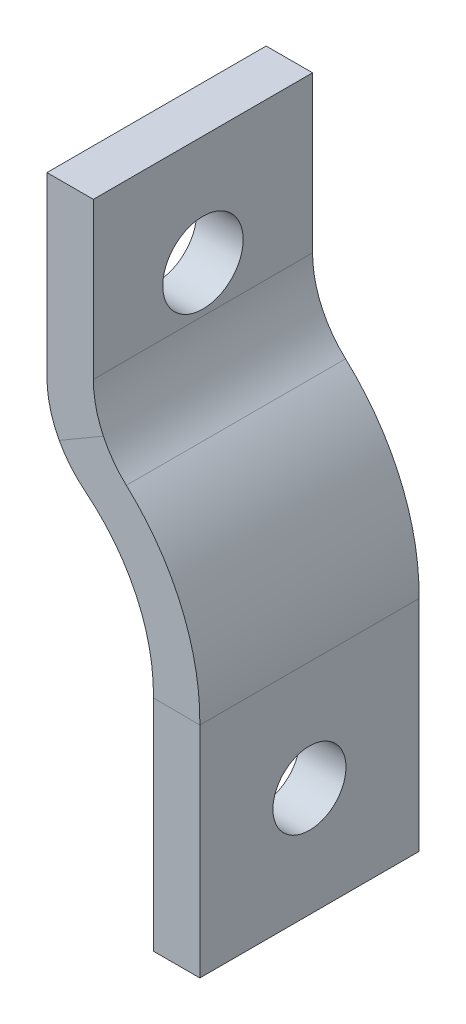
ISO-10303-21;
HEADER;
FILE_DESCRIPTION(('STEP AP214'),'2;1');
FILE_NAME('part.step','',(''),(''),'','','');
FILE_SCHEMA(('AUTOMOTIVE_DESIGN { 1 0 10303 214 1 1 1 1 }'));
ENDSEC;
DATA;
#1=APPLICATION_CONTEXT('core data for automotive mechanical design processes');
#2=APPLICATION_PROTOCOL_DEFINITION('international standard','automotive_design',2000,#1);
#3=PRODUCT_CONTEXT('',#1,'mechanical');
#4=PRODUCT('Part','Part','',(#3));
#5=PRODUCT_RELATED_PRODUCT_CATEGORY('part','',(#4));
#6=PRODUCT_DEFINITION_FORMATION('','',#4);
#7=PRODUCT_DEFINITION_CONTEXT('part definition',#1,'design');
#8=PRODUCT_DEFINITION('design','',#6,#7);
#9=PRODUCT_DEFINITION_SHAPE('','',#8);
#10=(LENGTH_UNIT() NAMED_UNIT(*) SI_UNIT(.MILLI.,.METRE.));
#11=(NAMED_UNIT(*) PLANE_ANGLE_UNIT() SI_UNIT($,.RADIAN.));
#12=(NAMED_UNIT(*) SI_UNIT($,.STERADIAN.) SOLID_ANGLE_UNIT());
#13=UNCERTAINTY_MEASURE_WITH_UNIT(LENGTH_MEASURE(1.E-05),#10,'distance_accuracy_value','');
#14=(GEOMETRIC_REPRESENTATION_CONTEXT(3) GLOBAL_UNCERTAINTY_ASSIGNED_CONTEXT((#13)) GLOBAL_UNIT_ASSIGNED_CONTEXT((#10,
#11,#12)) REPRESENTATION_CONTEXT('',''));
#15=CARTESIAN_POINT('',(0.,0.,0.));
#16=DIRECTION('',(0.,0.,1.));
#17=DIRECTION('',(1.,0.,0.));
#18=AXIS2_PLACEMENT_3D('',#15,#16,#17);
#19=CARTESIAN_POINT('',(0.,7.5,0.));
#20=DIRECTION('',(0.,1.,0.));
#21=DIRECTION('',(0.,0.,1.));
#22=AXIS2_PLACEMENT_3D('',#19,#20,#21);
#23=PLANE('',#22);
#24=DIRECTION('',(0.,0.,1.));
#25=VECTOR('',#24,1.);
#26=CARTESIAN_POINT('',(-15.875,7.5,7.5));
#27=LINE('',#26,#25);
#28=CARTESIAN_POINT('',(-15.875,7.5,-7.5));
#29=VERTEX_POINT('',#28);
#30=CARTESIAN_POINT('',(-15.875,7.5,7.5));
#31=VERTEX_POINT('',#30);
#32=EDGE_CURVE('E277',#29,#31,#27,.T.);
#33=ORIENTED_EDGE('',*,*,#32,.T.);
#34=DIRECTION('',(1.,0.,0.));
#35=VECTOR('',#34,1.);
#36=CARTESIAN_POINT('',(-12.7,7.5,7.5));
#37=LINE('',#36,#35);
#38=CARTESIAN_POINT('',(-12.7,7.5,7.5));
#39=VERTEX_POINT('',#38);
#40=EDGE_CURVE('E281',#31,#39,#37,.T.);
#41=ORIENTED_EDGE('',*,*,#40,.T.);
#42=DIRECTION('',(0.,0.,-1.));
#43=VECTOR('',#42,1.);
#44=CARTESIAN_POINT('',(-12.7,7.5,7.5));
#45=LINE('',#44,#43);
#46=CARTESIAN_POINT('',(-12.7,7.5,-7.50000000000001));
#47=VERTEX_POINT('',#46);
#48=EDGE_CURVE('E264',#39,#47,#45,.T.);
#49=ORIENTED_EDGE('',*,*,#48,.T.);
#50=DIRECTION('',(-1.,0.,0.));
#51=VECTOR('',#50,1.);
#52=CARTESIAN_POINT('',(-12.7,7.5,-7.50000000000001));
#53=LINE('',#52,#51);
#54=EDGE_CURVE('E267',#47,#29,#53,.T.);
#55=ORIENTED_EDGE('',*,*,#54,.T.);
#56=EDGE_LOOP('',(#33,#41,#49,#55));
#57=FACE_BOUND('',#56,.T.);
#58=ADVANCED_FACE('F41',(#57),#23,.T.);
#59=CARTESIAN_POINT('',(7.28749999999999,-35.,0.));
#60=DIRECTION('',(0.,1.,0.));
#61=DIRECTION('',(0.,0.,1.));
#62=AXIS2_PLACEMENT_3D('',#59,#60,#61);
#63=PLANE('',#62);
#64=DIRECTION('',(0.,0.,1.));
#65=VECTOR('',#64,1.);
#66=CARTESIAN_POINT('',(-8.58750000000001,-35.,7.5));
#67=LINE('',#66,#65);
#68=CARTESIAN_POINT('',(-8.58750000000001,-35.,-7.5));
#69=VERTEX_POINT('',#68);
#70=CARTESIAN_POINT('',(-8.58750000000001,-35.,7.5));
#71=VERTEX_POINT('',#70);
#72=EDGE_CURVE('E156',#69,#71,#67,.T.);
#73=ORIENTED_EDGE('',*,*,#72,.F.);
#74=DIRECTION('',(-1.,0.,0.));
#75=VECTOR('',#74,1.);
#76=CARTESIAN_POINT('',(-5.4125,-35.,-7.50000000000001));
#77=LINE('',#76,#75);
#78=CARTESIAN_POINT('',(-5.4125,-35.,-7.50000000000001));
#79=VERTEX_POINT('',#78);
#80=EDGE_CURVE('E142',#79,#69,#77,.T.);
#81=ORIENTED_EDGE('',*,*,#80,.F.);
#82=DIRECTION('',(0.,0.,-1.));
#83=VECTOR('',#82,1.);
#84=CARTESIAN_POINT('',(-5.4125,-35.,7.5));
#85=LINE('',#84,#83);
#86=CARTESIAN_POINT('',(-5.4125,-35.,7.5));
#87=VERTEX_POINT('',#86);
#88=EDGE_CURVE('E136',#87,#79,#85,.T.);
#89=ORIENTED_EDGE('',*,*,#88,.F.);
#90=DIRECTION('',(1.,0.,0.));
#91=VECTOR('',#90,1.);
#92=CARTESIAN_POINT('',(-5.4125,-35.,7.5));
#93=LINE('',#92,#91);
#94=EDGE_CURVE('E139',#71,#87,#93,.T.);
#95=ORIENTED_EDGE('',*,*,#94,.F.);
#96=EDGE_LOOP('',(#73,#81,#89,#95));
#97=FACE_BOUND('',#96,.T.);
#98=ADVANCED_FACE('F138',(#97),#63,.F.);
#99=CARTESIAN_POINT('',(-12.7,-8.63596447973732,7.5));
#100=DIRECTION('',(1.,0.,0.));
#101=DIRECTION('',(0.,0.,-1.));
#102=AXIS2_PLACEMENT_3D('',#99,#100,#101);
#103=PLANE('',#102);
#104=CARTESIAN_POINT('',(-12.7,0.,0.));
#105=DIRECTION('',(1.,0.,0.));
#106=DIRECTION('',(0.,0.,-1.));
#107=AXIS2_PLACEMENT_3D('',#104,#105,#106);
#108=CIRCLE('',#107,2.74999999999999);
#109=CARTESIAN_POINT('',(-12.7,0.,-2.74999999999999));
#110=VERTEX_POINT('',#109);
#111=EDGE_CURVE('E274',#110,#110,#108,.T.);
#112=ORIENTED_EDGE('',*,*,#111,.F.);
#113=EDGE_LOOP('',(#112));
#114=FACE_BOUND('',#113,.T.);
#115=DIRECTION('',(0.,1.,0.));
#116=VECTOR('',#115,1.);
#117=CARTESIAN_POINT('',(-12.7,-8.63596447973732,7.5));
#118=LINE('',#117,#116);
#119=CARTESIAN_POINT('',(-12.7,-3.16883910186593,7.5));
#120=VERTEX_POINT('',#119);
#121=EDGE_CURVE('E272',#120,#39,#118,.T.);
#122=ORIENTED_EDGE('',*,*,#121,.F.);
#123=DIRECTION('',(0.,0.,-1.));
#124=VECTOR('',#123,1.);
#125=CARTESIAN_POINT('',(-12.7,-3.16883910186593,-7.50000000000001));
#126=LINE('',#125,#124);
#127=CARTESIAN_POINT('',(-12.7,-3.16883910186593,-7.50000000000001));
#128=VERTEX_POINT('',#127);
#129=EDGE_CURVE('E180',#120,#128,#126,.T.);
#130=ORIENTED_EDGE('',*,*,#129,.T.);
#131=DIRECTION('',(0.,1.,0.));
#132=VECTOR('',#131,1.);
#133=CARTESIAN_POINT('',(-12.7,-8.63596447973732,-7.50000000000001));
#134=LINE('',#133,#132);
#135=EDGE_CURVE('E269',#128,#47,#134,.T.);
#136=ORIENTED_EDGE('',*,*,#135,.T.);
#137=ORIENTED_EDGE('',*,*,#48,.F.);
#138=EDGE_LOOP('',(#122,#130,#136,#137));
#139=FACE_BOUND('',#138,.T.);
#140=ADVANCED_FACE('F325',(#114,#139),#103,.T.);
#141=CARTESIAN_POINT('',(-12.7,-8.63596447973732,-7.50000000000001));
#142=DIRECTION('',(0.,0.,-1.));
#143=DIRECTION('',(-1.,0.,0.));
#144=AXIS2_PLACEMENT_3D('',#141,#142,#143);
#145=PLANE('',#144);
#146=DIRECTION('',(0.86402504386111,0.503448829158245,0.));
#147=VECTOR('',#146,1.);
#148=CARTESIAN_POINT('',(-15.8750001084359,-8.44178557368542,-7.5));
#149=LINE('',#148,#147);
#150=CARTESIAN_POINT('',(-15.0340997008918,-7.95181097326771,-7.5));
#151=VERTEX_POINT('',#150);
#152=CARTESIAN_POINT('',(-12.0135985680038,-6.19182985972482,-7.5));
#153=VERTEX_POINT('',#152);
#154=EDGE_CURVE('E65',#151,#153,#149,.T.);
#155=ORIENTED_EDGE('',*,*,#154,.F.);
#156=CARTESIAN_POINT('',(-8.875,-4.625327713957,-7.50000000000001));
#157=DIRECTION('',(0.,0.,-1.));
#158=DIRECTION('',(-1.,0.,0.));
#159=AXIS2_PLACEMENT_3D('',#156,#157,#158);
#160=CIRCLE('',#159,7.);
#161=CARTESIAN_POINT('',(-15.875,-4.625327713957,-7.5));
#162=VERTEX_POINT('',#161);
#163=EDGE_CURVE('E295',#151,#162,#160,.T.);
#164=ORIENTED_EDGE('',*,*,#163,.T.);
#165=DIRECTION('',(0.,1.,0.));
#166=VECTOR('',#165,1.);
#167=CARTESIAN_POINT('',(-15.875,-8.63596447973732,-7.5));
#168=LINE('',#167,#166);
#169=EDGE_CURVE('E271',#162,#29,#168,.T.);
#170=ORIENTED_EDGE('',*,*,#169,.T.);
#171=ORIENTED_EDGE('',*,*,#54,.F.);
#172=ORIENTED_EDGE('',*,*,#135,.F.);
#173=CARTESIAN_POINT('',(-5.7,-3.16883910186593,-7.50000000000001));
#174=DIRECTION('',(0.,0.,-1.));
#175=DIRECTION('',(-1.,0.,0.));
#176=AXIS2_PLACEMENT_3D('',#173,#174,#175);
#177=CIRCLE('',#176,7.);
#178=EDGE_CURVE('E305',#128,#153,#177,.F.);
#179=ORIENTED_EDGE('',*,*,#178,.T.);
#180=EDGE_LOOP('',(#155,#164,#170,#171,#172,#179));
#181=FACE_BOUND('',#180,.T.);
#182=ADVANCED_FACE('F331',(#181),#145,.T.);
#183=CARTESIAN_POINT('',(-12.7,-8.63596447973732,7.5));
#184=DIRECTION('',(0.,0.,1.));
#185=DIRECTION('',(1.,0.,0.));
#186=AXIS2_PLACEMENT_3D('',#183,#184,#185);
#187=PLANE('',#186);
#188=DIRECTION('',(0.,1.,0.));
#189=VECTOR('',#188,1.);
#190=CARTESIAN_POINT('',(-15.875,-8.63596447973732,7.5));
#191=LINE('',#190,#189);
#192=CARTESIAN_POINT('',(-15.875,-4.625327713957,7.5));
#193=VERTEX_POINT('',#192);
#194=EDGE_CURVE('E268',#193,#31,#191,.T.);
#195=ORIENTED_EDGE('',*,*,#194,.F.);
#196=CARTESIAN_POINT('',(-8.875,-4.625327713957,7.5));
#197=DIRECTION('',(0.,0.,1.));
#198=DIRECTION('',(1.,0.,0.));
#199=AXIS2_PLACEMENT_3D('',#196,#197,#198);
#200=CIRCLE('',#199,7.);
#201=CARTESIAN_POINT('',(-15.0340997008918,-7.95181097326771,7.5));
#202=VERTEX_POINT('',#201);
#203=EDGE_CURVE('E301',#193,#202,#200,.T.);
#204=ORIENTED_EDGE('',*,*,#203,.T.);
#205=DIRECTION('',(-0.86402504386111,-0.503448829158245,0.));
#206=VECTOR('',#205,1.);
#207=CARTESIAN_POINT('',(-12.7,-6.59178122655878,7.5));
#208=LINE('',#207,#206);
#209=CARTESIAN_POINT('',(-12.0135985680038,-6.19182985972482,7.5));
#210=VERTEX_POINT('',#209);
#211=EDGE_CURVE('E57',#210,#202,#208,.T.);
#212=ORIENTED_EDGE('',*,*,#211,.F.);
#213=CARTESIAN_POINT('',(-5.7,-3.16883910186593,7.5));
#214=DIRECTION('',(0.,0.,1.));
#215=DIRECTION('',(1.,0.,0.));
#216=AXIS2_PLACEMENT_3D('',#213,#214,#215);
#217=CIRCLE('',#216,7.);
#218=EDGE_CURVE('E11',#210,#120,#217,.F.);
#219=ORIENTED_EDGE('',*,*,#218,.T.);
#220=ORIENTED_EDGE('',*,*,#121,.T.);
#221=ORIENTED_EDGE('',*,*,#40,.F.);
#222=EDGE_LOOP('',(#195,#204,#212,#219,#220,#221));
#223=FACE_BOUND('',#222,.T.);
#224=ADVANCED_FACE('F321',(#223),#187,.T.);
#225=CARTESIAN_POINT('',(-15.875,-8.63596447973732,7.5));
#226=DIRECTION('',(-1.,0.,0.));
#227=DIRECTION('',(0.,0.,1.));
#228=AXIS2_PLACEMENT_3D('',#225,#226,#227);
#229=PLANE('',#228);
#230=CARTESIAN_POINT('',(-15.875,0.,0.));
#231=DIRECTION('',(-1.,0.,0.));
#232=DIRECTION('',(0.,0.,1.));
#233=AXIS2_PLACEMENT_3D('',#230,#231,#232);
#234=CIRCLE('',#233,2.74999999999999);
#235=CARTESIAN_POINT('',(-15.875,0.,2.74999999999999));
#236=VERTEX_POINT('',#235);
#237=EDGE_CURVE('E378',#236,#236,#234,.T.);
#238=ORIENTED_EDGE('',*,*,#237,.F.);
#239=EDGE_LOOP('',(#238));
#240=FACE_BOUND('',#239,.T.);
#241=ORIENTED_EDGE('',*,*,#169,.F.);
#242=DIRECTION('',(0.,0.,1.));
#243=VECTOR('',#242,1.);
#244=CARTESIAN_POINT('',(-15.875,-4.625327713957,7.5));
#245=LINE('',#244,#243);
#246=EDGE_CURVE('E299',#162,#193,#245,.T.);
#247=ORIENTED_EDGE('',*,*,#246,.T.);
#248=ORIENTED_EDGE('',*,*,#194,.T.);
#249=ORIENTED_EDGE('',*,*,#32,.F.);
#250=EDGE_LOOP('',(#241,#247,#248,#249));
#251=FACE_BOUND('',#250,.T.);
#252=ADVANCED_FACE('F336',(#240,#251),#229,.T.);
#253=CARTESIAN_POINT('',(-20.9983757298086,-19.7867468004784,0.));
#254=DIRECTION('',(0.,0.,1.));
#255=DIRECTION('',(1.,0.,0.));
#256=AXIS2_PLACEMENT_3D('',#253,#254,#255);
#257=CYLINDRICAL_SURFACE('',#256,15.5875);
#258=CARTESIAN_POINT('',(-20.9983757298086,-19.7867468004784,-7.50000000000001));
#259=DIRECTION('',(0.,0.,1.));
#260=DIRECTION('',(0.999883980700613,-0.0152323713944,0.));
#261=AXIS2_PLACEMENT_3D('',#258,#259,#260);
#262=CIRCLE('',#261,15.5875);
#263=CARTESIAN_POINT('',(-5.41250000000001,-20.0117667661794,-7.50000000000001));
#264=VERTEX_POINT('',#263);
#265=CARTESIAN_POINT('',(-10.4410572267254,-8.31882709922231,-7.50000000000001));
#266=VERTEX_POINT('',#265);
#267=EDGE_CURVE('E181',#264,#266,#262,.T.);
#268=ORIENTED_EDGE('',*,*,#267,.T.);
#269=DIRECTION('',(0.,0.,1.));
#270=VECTOR('',#269,1.);
#271=CARTESIAN_POINT('',(-10.4410572267254,-8.31882709922231,0.));
#272=LINE('',#271,#270);
#273=CARTESIAN_POINT('',(-10.4410572267254,-8.31882709922231,7.5));
#274=VERTEX_POINT('',#273);
#275=EDGE_CURVE('E287',#266,#274,#272,.T.);
#276=ORIENTED_EDGE('',*,*,#275,.T.);
#277=CARTESIAN_POINT('',(-20.9983757298086,-19.7867468004784,7.5));
#278=DIRECTION('',(0.,0.,1.));
#279=DIRECTION('',(0.999883980700613,-0.0152323713944,0.));
#280=AXIS2_PLACEMENT_3D('',#277,#278,#279);
#281=CIRCLE('',#280,15.5875);
#282=CARTESIAN_POINT('',(-5.41250000000001,-20.0117667661794,7.5));
#283=VERTEX_POINT('',#282);
#284=EDGE_CURVE('E185',#283,#274,#281,.T.);
#285=ORIENTED_EDGE('',*,*,#284,.F.);
#286=DIRECTION('',(0.,0.,1.));
#287=VECTOR('',#286,1.);
#288=CARTESIAN_POINT('',(-5.41250000000001,-20.0117667661794,0.));
#289=LINE('',#288,#287);
#290=EDGE_CURVE('E160',#283,#264,#289,.F.);
#291=ORIENTED_EDGE('',*,*,#290,.T.);
#292=EDGE_LOOP('',(#268,#276,#285,#291));
#293=FACE_BOUND('',#292,.T.);
#294=ADVANCED_FACE('F208',(#293),#257,.T.);
#295=CARTESIAN_POINT('',(-8.59036229364111,-20.1757954065515,-7.5));
#296=CARTESIAN_POINT('',(-8.58939004397634,-20.1119749520755,-7.5));
#297=CARTESIAN_POINT('',(-8.58827268052776,-20.0386982245083,-7.5));
#298=CARTESIAN_POINT('',(-8.58276606769066,-19.6768341394664,-7.5));
#299=CARTESIAN_POINT('',(-8.58830167751701,-19.4137376399685,-7.5));
#300=CARTESIAN_POINT('',(-8.61788392858124,-18.8526715481281,-7.5));
#301=CARTESIAN_POINT('',(-8.64220003351567,-18.5726729782134,-7.5));
#302=CARTESIAN_POINT('',(-8.74355113545508,-17.7361328080536,-7.5));
#303=CARTESIAN_POINT('',(-8.84903652110424,-17.1830462968838,-7.5));
#304=CARTESIAN_POINT('',(-9.27630314780402,-15.5529135828288,-7.5));
#305=CARTESIAN_POINT('',(-9.70933107906704,-14.5056699926504,-7.5));
#306=CARTESIAN_POINT('',(-10.8409984311133,-12.5645596117847,-7.5));
#307=CARTESIAN_POINT('',(-11.5389961946689,-11.6717934338356,-7.5));
#308=CARTESIAN_POINT('',(-12.7470748820603,-10.4968741511599,-7.5));
#309=CARTESIAN_POINT('',(-13.1764140352401,-10.1325943864644,-7.5));
#310=CARTESIAN_POINT('',(-13.8544574113397,-9.63226581213585,-7.5));
#311=CARTESIAN_POINT('',(-14.08613854625,-9.47316105469909,-7.5));
#312=CARTESIAN_POINT('',(-14.5598162119036,-9.17100258956319,-7.5));
#313=CARTESIAN_POINT('',(-14.786041221195,-9.03656800995533,-7.5));
#314=CARTESIAN_POINT('',(-15.3619381229485,-8.72200738664864,-7.5));
#315=CARTESIAN_POINT('',(-15.7272498350888,-8.52248528261496,-7.5));
#316=CARTESIAN_POINT('',(-16.0454159398529,-8.34870672062612,-7.5));
#317=CARTESIAN_POINT('',(-8.59036229364111,-20.1757954065515,7.5));
#318=CARTESIAN_POINT('',(-8.58939004397634,-20.1119749520755,7.5));
#319=CARTESIAN_POINT('',(-8.58827268052776,-20.0386982245083,7.5));
#320=CARTESIAN_POINT('',(-8.58276606769066,-19.6768341394664,7.5));
#321=CARTESIAN_POINT('',(-8.58830167751701,-19.4137376399685,7.5));
#322=CARTESIAN_POINT('',(-8.61788392858124,-18.8526715481281,7.5));
#323=CARTESIAN_POINT('',(-8.64220003351567,-18.5726729782134,7.5));
#324=CARTESIAN_POINT('',(-8.74355113545508,-17.7361328080536,7.5));
#325=CARTESIAN_POINT('',(-8.84903652110424,-17.1830462968838,7.5));
#326=CARTESIAN_POINT('',(-9.27630314780402,-15.5529135828288,7.5));
#327=CARTESIAN_POINT('',(-9.70933107906704,-14.5056699926504,7.5));
#328=CARTESIAN_POINT('',(-10.8409984311133,-12.5645596117847,7.5));
#329=CARTESIAN_POINT('',(-11.5389961946689,-11.6717934338356,7.5));
#330=CARTESIAN_POINT('',(-12.7470748820603,-10.4968741511599,7.5));
#331=CARTESIAN_POINT('',(-13.1764140352401,-10.1325943864644,7.5));
#332=CARTESIAN_POINT('',(-13.8544574113397,-9.63226581213585,7.5));
#333=CARTESIAN_POINT('',(-14.08613854625,-9.47316105469909,7.5));
#334=CARTESIAN_POINT('',(-14.5598162119036,-9.17100258956319,7.5));
#335=CARTESIAN_POINT('',(-14.786041221195,-9.03656800995533,7.5));
#336=CARTESIAN_POINT('',(-15.3619381229485,-8.72200738664864,7.5));
#337=CARTESIAN_POINT('',(-15.7272498350888,-8.52248528261496,7.5));
#338=CARTESIAN_POINT('',(-16.0454159398529,-8.34870672062612,7.5));
#339=B_SPLINE_SURFACE_WITH_KNOTS('',1,3,((#295,#296,#297,#298,#299,#300,#301,#302,#303,#304,
#305,#306,#307,#308,#309,#310,#311,#312,#313,#314,#315,#316),(#317,#318,#319,#320,#321,#322,
#323,#324,#325,#326,#327,#328,#329,#330,#331,#332,#333,#334,#335,#336,#337,#338)),.UNSPECIFIED.,
.F.,.F.,.F.,(2,2),(4,2,2,2,2,2,2,2,2,2,4),(0.,1.),(-0.0131444147203949,0.,0.0625,0.125,0.25,0.5,
0.75,0.875,0.9375,1.,1.07465794114652),.UNSPECIFIED.);
#340=CARTESIAN_POINT('',(-20.9983757298086,-19.7867468004784,7.5));
#341=DIRECTION('',(0.,0.,1.));
#342=DIRECTION('',(0.999883980700613,-0.0152323713943998,0.));
#343=AXIS2_PLACEMENT_3D('',#340,#341,#342);
#344=CIRCLE('',#343,12.4125);
#345=CARTESIAN_POINT('',(-8.58731581936223,-19.9758186104114,7.5));
#346=VERTEX_POINT('',#345);
#347=CARTESIAN_POINT('',(-13.2466523854834,-10.0923564893368,7.5));
#348=VERTEX_POINT('',#347);
#349=EDGE_CURVE('E238',#346,#348,#344,.T.);
#350=DIRECTION('',(0.,0.,1.));
#351=VECTOR('',#350,1.);
#352=CARTESIAN_POINT('',(-13.2466636148676,-10.0923705378649,7.5));
#353=LINE('',#352,#351);
#354=CARTESIAN_POINT('',(-13.2466564763725,-10.0923616061491,-7.5));
#355=VERTEX_POINT('',#354);
#356=EDGE_CURVE('E289',#348,#355,#353,.F.);
#357=CARTESIAN_POINT('',(-20.9983757298086,-19.7867468004784,-7.5));
#358=DIRECTION('',(0.,0.,1.));
#359=DIRECTION('',(0.999883980700613,-0.0152323713943998,0.));
#360=AXIS2_PLACEMENT_3D('',#357,#358,#359);
#361=CIRCLE('',#360,12.4125);
#362=CARTESIAN_POINT('',(-8.58731581936223,-19.9758186104114,-7.5));
#363=VERTEX_POINT('',#362);
#364=EDGE_CURVE('E184',#363,#355,#361,.T.);
#365=DIRECTION('',(0.0152323713944003,0.999883980700613,0.));
#366=VECTOR('',#365,1.);
#367=CARTESIAN_POINT('',(-8.59036229364111,-20.1757954065515,-7.5));
#368=LINE('',#367,#366);
#369=CARTESIAN_POINT('',(-8.58750004408827,-19.9879201813065,-7.5));
#370=VERTEX_POINT('',#369);
#371=EDGE_CURVE('E261',#370,#363,#368,.T.);
#372=DIRECTION('',(0.,0.,1.));
#373=VECTOR('',#372,1.);
#374=CARTESIAN_POINT('',(-8.58750000000001,-19.9879201826498,0.));
#375=LINE('',#374,#373);
#376=CARTESIAN_POINT('',(-8.58750004408827,-19.9879201813065,7.5));
#377=VERTEX_POINT('',#376);
#378=EDGE_CURVE('E170',#377,#370,#375,.F.);
#379=DIRECTION('',(0.0152323713944003,0.999883980700613,0.));
#380=VECTOR('',#379,1.);
#381=CARTESIAN_POINT('',(-8.59036229364111,-20.1757954065515,7.5));
#382=LINE('',#381,#380);
#383=EDGE_CURVE('E188',#377,#346,#382,.T.);
#384=ORIENTED_EDGE('',*,*,#349,.T.);
#385=ORIENTED_EDGE('',*,*,#356,.T.);
#386=ORIENTED_EDGE('',*,*,#364,.F.);
#387=ORIENTED_EDGE('',*,*,#371,.F.);
#388=ORIENTED_EDGE('',*,*,#378,.F.);
#389=ORIENTED_EDGE('',*,*,#383,.T.);
#390=EDGE_LOOP('',(#384,#385,#386,#387,#388,#389));
#391=FACE_BOUND('',#390,.T.);
#392=ADVANCED_FACE('F195',(#391),#339,.T.);
#393=CARTESIAN_POINT('',(-5.41573065491666,-20.2241581857287,7.5));
#394=DIRECTION('',(0.,0.,1.));
#395=DIRECTION('',(1.,0.,0.));
#396=AXIS2_PLACEMENT_3D('',#393,#394,#395);
#397=PLANE('',#396);
#398=ORIENTED_EDGE('',*,*,#211,.T.);
#399=CARTESIAN_POINT('',(-8.875,-4.625327713957,7.5));
#400=DIRECTION('',(0.,0.,1.));
#401=DIRECTION('',(1.,0.,0.));
#402=AXIS2_PLACEMENT_3D('',#399,#400,#401);
#403=CIRCLE('',#402,7.);
#404=EDGE_CURVE('E303',#202,#348,#403,.T.);
#405=ORIENTED_EDGE('',*,*,#404,.T.);
#406=ORIENTED_EDGE('',*,*,#349,.F.);
#407=ORIENTED_EDGE('',*,*,#383,.F.);
#408=DIRECTION('',(0.999971795620203,-0.00751052355741597,0.));
#409=VECTOR('',#408,1.);
#410=CARTESIAN_POINT('',(-8.58750000000001,-19.9879201813065,7.5));
#411=LINE('',#410,#409);
#412=EDGE_CURVE('E175',#377,#283,#411,.T.);
#413=ORIENTED_EDGE('',*,*,#412,.T.);
#414=ORIENTED_EDGE('',*,*,#284,.T.);
#415=CARTESIAN_POINT('',(-5.7,-3.16883910186593,7.5));
#416=DIRECTION('',(0.,0.,1.));
#417=DIRECTION('',(1.,0.,0.));
#418=AXIS2_PLACEMENT_3D('',#415,#416,#417);
#419=CIRCLE('',#418,7.);
#420=EDGE_CURVE('E50',#274,#210,#419,.F.);
#421=ORIENTED_EDGE('',*,*,#420,.T.);
#422=EDGE_LOOP('',(#398,#405,#406,#407,#413,#414,#421));
#423=FACE_BOUND('',#422,.T.);
#424=ADVANCED_FACE('F207',(#423),#397,.T.);
#425=CARTESIAN_POINT('',(-5.41573065491666,-20.2241581857287,-7.50000000000001));
#426=DIRECTION('',(0.,0.,-1.));
#427=DIRECTION('',(-1.,0.,0.));
#428=AXIS2_PLACEMENT_3D('',#425,#426,#427);
#429=PLANE('',#428);
#430=ORIENTED_EDGE('',*,*,#364,.T.);
#431=CARTESIAN_POINT('',(-8.875,-4.625327713957,-7.5));
#432=DIRECTION('',(0.,0.,-1.));
#433=DIRECTION('',(-1.,0.,0.));
#434=AXIS2_PLACEMENT_3D('',#431,#432,#433);
#435=CIRCLE('',#434,7.);
#436=EDGE_CURVE('E291',#355,#151,#435,.T.);
#437=ORIENTED_EDGE('',*,*,#436,.T.);
#438=ORIENTED_EDGE('',*,*,#154,.T.);
#439=CARTESIAN_POINT('',(-5.7,-3.16883910186593,-7.50000000000001));
#440=DIRECTION('',(0.,0.,-1.));
#441=DIRECTION('',(-1.,0.,0.));
#442=AXIS2_PLACEMENT_3D('',#439,#440,#441);
#443=CIRCLE('',#442,7.);
#444=EDGE_CURVE('E309',#153,#266,#443,.F.);
#445=ORIENTED_EDGE('',*,*,#444,.T.);
#446=ORIENTED_EDGE('',*,*,#267,.F.);
#447=DIRECTION('',(0.999971795620203,-0.00751052355741597,0.));
#448=VECTOR('',#447,1.);
#449=CARTESIAN_POINT('',(-8.58750000000001,-19.9879201813065,-7.5));
#450=LINE('',#449,#448);
#451=EDGE_CURVE('E177',#370,#264,#450,.T.);
#452=ORIENTED_EDGE('',*,*,#451,.F.);
#453=ORIENTED_EDGE('',*,*,#371,.T.);
#454=EDGE_LOOP('',(#430,#437,#438,#445,#446,#452,#453));
#455=FACE_BOUND('',#454,.T.);
#456=ADVANCED_FACE('F210',(#455),#429,.T.);
#457=CARTESIAN_POINT('',(-5.4125,-35.,7.5));
#458=DIRECTION('',(1.,0.,0.));
#459=DIRECTION('',(0.,1.,0.));
#460=AXIS2_PLACEMENT_3D('',#457,#458,#459);
#461=PLANE('',#460);
#462=CARTESIAN_POINT('',(-5.4125,-27.5,0.));
#463=DIRECTION('',(1.,0.,0.));
#464=DIRECTION('',(0.,1.,0.));
#465=AXIS2_PLACEMENT_3D('',#462,#463,#464);
#466=CIRCLE('',#465,2.5);
#467=CARTESIAN_POINT('',(-5.4125,-25.,0.));
#468=VERTEX_POINT('',#467);
#469=EDGE_CURVE('E376',#468,#468,#466,.T.);
#470=ORIENTED_EDGE('',*,*,#469,.F.);
#471=EDGE_LOOP('',(#470));
#472=FACE_BOUND('',#471,.T.);
#473=ORIENTED_EDGE('',*,*,#290,.F.);
#474=DIRECTION('',(0.,1.,0.));
#475=VECTOR('',#474,1.);
#476=CARTESIAN_POINT('',(-5.4125,-35.,7.5));
#477=LINE('',#476,#475);
#478=EDGE_CURVE('E153',#87,#283,#477,.T.);
#479=ORIENTED_EDGE('',*,*,#478,.F.);
#480=ORIENTED_EDGE('',*,*,#88,.T.);
#481=DIRECTION('',(0.,1.,0.));
#482=VECTOR('',#481,1.);
#483=CARTESIAN_POINT('',(-5.4125,-35.,-7.50000000000001));
#484=LINE('',#483,#482);
#485=EDGE_CURVE('E161',#79,#264,#484,.T.);
#486=ORIENTED_EDGE('',*,*,#485,.T.);
#487=EDGE_LOOP('',(#473,#479,#480,#486));
#488=FACE_BOUND('',#487,.T.);
#489=ADVANCED_FACE('F159',(#472,#488),#461,.T.);
#490=CARTESIAN_POINT('',(-5.4125,-35.,7.5));
#491=DIRECTION('',(0.,0.,1.));
#492=DIRECTION('',(1.,0.,0.));
#493=AXIS2_PLACEMENT_3D('',#490,#491,#492);
#494=PLANE('',#493);
#495=ORIENTED_EDGE('',*,*,#412,.F.);
#496=DIRECTION('',(0.,1.,0.));
#497=VECTOR('',#496,1.);
#498=CARTESIAN_POINT('',(-8.58750000000001,-35.,7.5));
#499=LINE('',#498,#497);
#500=EDGE_CURVE('E155',#71,#377,#499,.T.);
#501=ORIENTED_EDGE('',*,*,#500,.F.);
#502=ORIENTED_EDGE('',*,*,#94,.T.);
#503=ORIENTED_EDGE('',*,*,#478,.T.);
#504=EDGE_LOOP('',(#495,#501,#502,#503));
#505=FACE_BOUND('',#504,.T.);
#506=ADVANCED_FACE('F152',(#505),#494,.T.);
#507=CARTESIAN_POINT('',(-8.58750000000001,-35.,7.5));
#508=DIRECTION('',(-1.,0.,0.));
#509=DIRECTION('',(0.,-1.,0.));
#510=AXIS2_PLACEMENT_3D('',#507,#508,#509);
#511=PLANE('',#510);
#512=CARTESIAN_POINT('',(-8.58750000000001,-27.5,0.));
#513=DIRECTION('',(-1.,0.,0.));
#514=DIRECTION('',(0.,-1.,0.));
#515=AXIS2_PLACEMENT_3D('',#512,#513,#514);
#516=CIRCLE('',#515,2.5);
#517=CARTESIAN_POINT('',(-8.58750000000001,-30.,0.));
#518=VERTEX_POINT('',#517);
#519=EDGE_CURVE('E45',#518,#518,#516,.T.);
#520=ORIENTED_EDGE('',*,*,#519,.F.);
#521=EDGE_LOOP('',(#520));
#522=FACE_BOUND('',#521,.T.);
#523=ORIENTED_EDGE('',*,*,#500,.T.);
#524=ORIENTED_EDGE('',*,*,#378,.T.);
#525=DIRECTION('',(0.,1.,0.));
#526=VECTOR('',#525,1.);
#527=CARTESIAN_POINT('',(-8.58750000000001,-35.,-7.5));
#528=LINE('',#527,#526);
#529=EDGE_CURVE('E163',#69,#370,#528,.T.);
#530=ORIENTED_EDGE('',*,*,#529,.F.);
#531=ORIENTED_EDGE('',*,*,#72,.T.);
#532=EDGE_LOOP('',(#523,#524,#530,#531));
#533=FACE_BOUND('',#532,.T.);
#534=ADVANCED_FACE('F342',(#522,#533),#511,.T.);
#535=CARTESIAN_POINT('',(-5.4125,-35.,-7.50000000000001));
#536=DIRECTION('',(0.,0.,-1.));
#537=DIRECTION('',(-1.,0.,0.));
#538=AXIS2_PLACEMENT_3D('',#535,#536,#537);
#539=PLANE('',#538);
#540=ORIENTED_EDGE('',*,*,#529,.T.);
#541=ORIENTED_EDGE('',*,*,#451,.T.);
#542=ORIENTED_EDGE('',*,*,#485,.F.);
#543=ORIENTED_EDGE('',*,*,#80,.T.);
#544=EDGE_LOOP('',(#540,#541,#542,#543));
#545=FACE_BOUND('',#544,.T.);
#546=ADVANCED_FACE('F345',(#545),#539,.T.);
#547=CARTESIAN_POINT('',(-5.7,-3.16883910186593,0.));
#548=DIRECTION('',(0.,0.,1.));
#549=DIRECTION('',(1.,0.,0.));
#550=AXIS2_PLACEMENT_3D('',#547,#548,#549);
#551=CYLINDRICAL_SURFACE('',#550,7.);
#552=ORIENTED_EDGE('',*,*,#420,.F.);
#553=ORIENTED_EDGE('',*,*,#275,.F.);
#554=ORIENTED_EDGE('',*,*,#444,.F.);
#555=ORIENTED_EDGE('',*,*,#178,.F.);
#556=ORIENTED_EDGE('',*,*,#129,.F.);
#557=ORIENTED_EDGE('',*,*,#218,.F.);
#558=EDGE_LOOP('',(#552,#553,#554,#555,#556,#557));
#559=FACE_BOUND('',#558,.T.);
#560=ADVANCED_FACE('F318',(#559),#551,.F.);
#561=CARTESIAN_POINT('',(-8.875,-4.625327713957,0.));
#562=DIRECTION('',(0.,0.,1.));
#563=DIRECTION('',(1.,0.,0.));
#564=AXIS2_PLACEMENT_3D('',#561,#562,#563);
#565=CYLINDRICAL_SURFACE('',#564,7.);
#566=ORIENTED_EDGE('',*,*,#203,.F.);
#567=ORIENTED_EDGE('',*,*,#246,.F.);
#568=ORIENTED_EDGE('',*,*,#163,.F.);
#569=ORIENTED_EDGE('',*,*,#436,.F.);
#570=ORIENTED_EDGE('',*,*,#356,.F.);
#571=ORIENTED_EDGE('',*,*,#404,.F.);
#572=EDGE_LOOP('',(#566,#567,#568,#569,#570,#571));
#573=FACE_BOUND('',#572,.T.);
#574=ADVANCED_FACE('F43',(#573),#565,.T.);
#575=CARTESIAN_POINT('',(-15.875,0.,0.));
#576=DIRECTION('',(-1.,0.,0.));
#577=DIRECTION('',(0.,0.,1.));
#578=AXIS2_PLACEMENT_3D('',#575,#576,#577);
#579=CYLINDRICAL_SURFACE('',#578,2.74999999999999);
#580=ORIENTED_EDGE('',*,*,#111,.T.);
#581=EDGE_LOOP('',(#580));
#582=FACE_BOUND('',#581,.T.);
#583=ORIENTED_EDGE('',*,*,#237,.T.);
#584=EDGE_LOOP('',(#583));
#585=FACE_BOUND('',#584,.T.);
#586=ADVANCED_FACE('F387',(#582,#585),#579,.F.);
#587=CARTESIAN_POINT('',(-5.41087572980857,-27.5,0.));
#588=DIRECTION('',(-1.,0.,0.));
#589=DIRECTION('',(0.,-1.,0.));
#590=AXIS2_PLACEMENT_3D('',#587,#588,#589);
#591=CYLINDRICAL_SURFACE('',#590,2.5);
#592=ORIENTED_EDGE('',*,*,#469,.T.);
#593=EDGE_LOOP('',(#592));
#594=FACE_BOUND('',#593,.T.);
#595=ORIENTED_EDGE('',*,*,#519,.T.);
#596=EDGE_LOOP('',(#595));
#597=FACE_BOUND('',#596,.T.);
#598=ADVANCED_FACE('F496',(#594,#597),#591,.F.);
#599=CLOSED_SHELL('',(#58,#98,#140,#182,#224,#252,#294,#392,#424,#456,#489,#506,#534,#546,#560,
#574,#586,#598));
#600=MANIFOLD_SOLID_BREP('B2',#599);
#601=ADVANCED_BREP_SHAPE_REPRESENTATION('',(#18,#600),#14);
#602=SHAPE_DEFINITION_REPRESENTATION(#9,#601);
ENDSEC;
END-ISO-10303-21;
